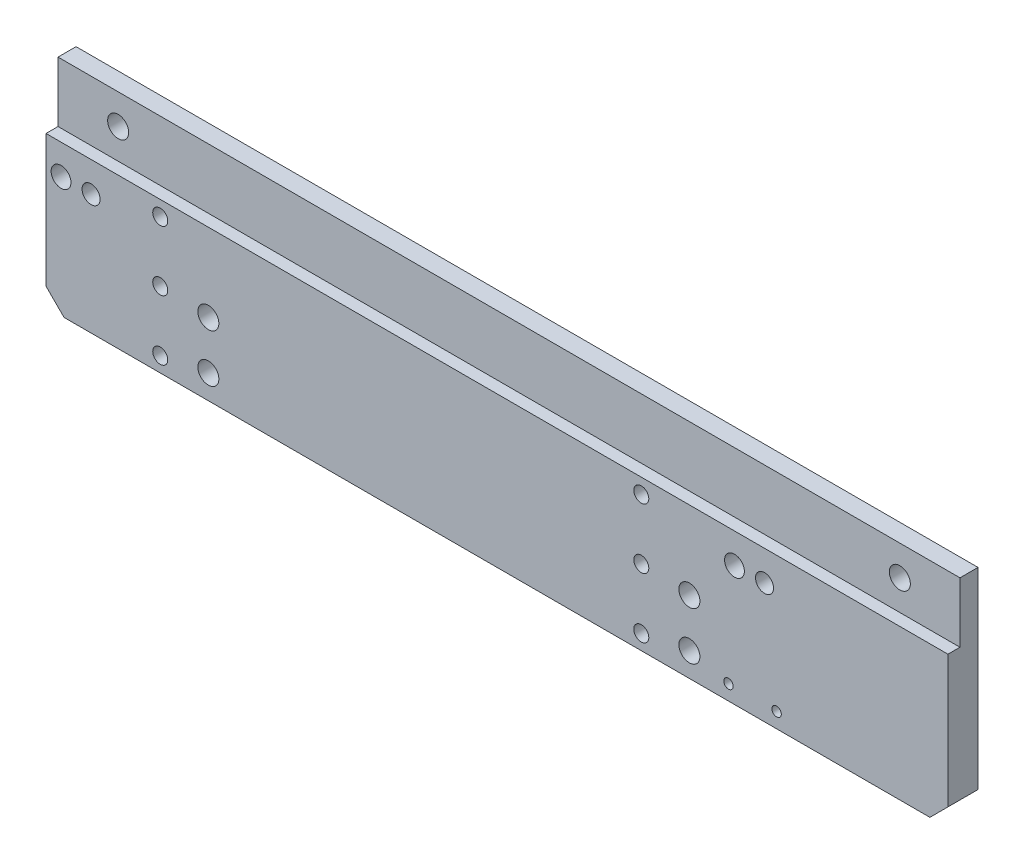
ISO-10303-21;
HEADER;
FILE_DESCRIPTION(('STEP AP214'),'2;1');
FILE_NAME('part.step','',(''),(''),'','','');
FILE_SCHEMA(('AUTOMOTIVE_DESIGN { 1 0 10303 214 1 1 1 1 }'));
ENDSEC;
DATA;
#1=APPLICATION_CONTEXT('core data for automotive mechanical design processes');
#2=APPLICATION_PROTOCOL_DEFINITION('international standard','automotive_design',2000,#1);
#3=PRODUCT_CONTEXT('',#1,'mechanical');
#4=PRODUCT('Part','Part','',(#3));
#5=PRODUCT_RELATED_PRODUCT_CATEGORY('part','',(#4));
#6=PRODUCT_DEFINITION_FORMATION('','',#4);
#7=PRODUCT_DEFINITION_CONTEXT('part definition',#1,'design');
#8=PRODUCT_DEFINITION('design','',#6,#7);
#9=PRODUCT_DEFINITION_SHAPE('','',#8);
#10=(LENGTH_UNIT() NAMED_UNIT(*) SI_UNIT(.MILLI.,.METRE.));
#11=(NAMED_UNIT(*) PLANE_ANGLE_UNIT() SI_UNIT($,.RADIAN.));
#12=(NAMED_UNIT(*) SI_UNIT($,.STERADIAN.) SOLID_ANGLE_UNIT());
#13=UNCERTAINTY_MEASURE_WITH_UNIT(LENGTH_MEASURE(1.E-05),#10,'distance_accuracy_value','');
#14=(GEOMETRIC_REPRESENTATION_CONTEXT(3) GLOBAL_UNCERTAINTY_ASSIGNED_CONTEXT((#13)) GLOBAL_UNIT_ASSIGNED_CONTEXT((#10,
#11,#12)) REPRESENTATION_CONTEXT('',''));
#15=CARTESIAN_POINT('',(0.,0.,0.));
#16=DIRECTION('',(0.,0.,1.));
#17=DIRECTION('',(1.,0.,0.));
#18=AXIS2_PLACEMENT_3D('',#15,#16,#17);
#19=CARTESIAN_POINT('',(-56.,-15.,5.));
#20=DIRECTION('',(0.,0.,-1.));
#21=DIRECTION('',(-1.,0.,0.));
#22=AXIS2_PLACEMENT_3D('',#19,#20,#21);
#23=CYLINDRICAL_SURFACE('',#22,1.25);
#24=CARTESIAN_POINT('',(-56.,-15.,5.));
#25=DIRECTION('',(0.,0.,-1.));
#26=DIRECTION('',(-1.,0.,0.));
#27=AXIS2_PLACEMENT_3D('',#24,#25,#26);
#28=CIRCLE('',#27,1.25);
#29=CARTESIAN_POINT('',(-57.25,-15.,5.));
#30=VERTEX_POINT('',#29);
#31=EDGE_CURVE('E210',#30,#30,#28,.T.);
#32=ORIENTED_EDGE('',*,*,#31,.F.);
#33=EDGE_LOOP('',(#32));
#34=FACE_BOUND('',#33,.T.);
#35=CARTESIAN_POINT('',(-56.,-15.,2.5));
#36=DIRECTION('',(0.,0.,-1.));
#37=DIRECTION('',(-1.,0.,0.));
#38=AXIS2_PLACEMENT_3D('',#35,#36,#37);
#39=CIRCLE('',#38,1.25);
#40=CARTESIAN_POINT('',(-57.25,-15.,2.5));
#41=VERTEX_POINT('',#40);
#42=EDGE_CURVE('E11',#41,#41,#39,.T.);
#43=ORIENTED_EDGE('',*,*,#42,.T.);
#44=EDGE_LOOP('',(#43));
#45=FACE_BOUND('',#44,.T.);
#46=ADVANCED_FACE('F33',(#34,#45),#23,.F.);
#47=CARTESIAN_POINT('',(-56.,-15.,2.5));
#48=DIRECTION('',(0.,0.,-1.));
#49=DIRECTION('',(-1.,0.,0.));
#50=AXIS2_PLACEMENT_3D('',#47,#48,#49);
#51=PLANE('',#50);
#52=ORIENTED_EDGE('',*,*,#42,.F.);
#53=EDGE_LOOP('',(#52));
#54=FACE_BOUND('',#53,.T.);
#55=CARTESIAN_POINT('',(-56.,-15.,2.5));
#56=DIRECTION('',(0.,0.,-1.));
#57=DIRECTION('',(-1.,0.,0.));
#58=AXIS2_PLACEMENT_3D('',#55,#56,#57);
#59=CIRCLE('',#58,2.);
#60=CARTESIAN_POINT('',(-58.,-15.,2.5));
#61=VERTEX_POINT('',#60);
#62=EDGE_CURVE('E40',#61,#61,#59,.T.);
#63=ORIENTED_EDGE('',*,*,#62,.T.);
#64=EDGE_LOOP('',(#63));
#65=FACE_BOUND('',#64,.T.);
#66=ADVANCED_FACE('F218',(#54,#65),#51,.T.);
#67=CARTESIAN_POINT('',(-56.,-15.,2.5));
#68=DIRECTION('',(0.,0.,-1.));
#69=DIRECTION('',(-1.,0.,0.));
#70=AXIS2_PLACEMENT_3D('',#67,#68,#69);
#71=CYLINDRICAL_SURFACE('',#70,2.);
#72=ORIENTED_EDGE('',*,*,#62,.F.);
#73=EDGE_LOOP('',(#72));
#74=FACE_BOUND('',#73,.T.);
#75=CARTESIAN_POINT('',(-56.,-15.,0.));
#76=DIRECTION('',(0.,0.,-1.));
#77=DIRECTION('',(-1.,0.,0.));
#78=AXIS2_PLACEMENT_3D('',#75,#76,#77);
#79=CIRCLE('',#78,2.);
#80=CARTESIAN_POINT('',(-58.,-15.,0.));
#81=VERTEX_POINT('',#80);
#82=EDGE_CURVE('E213',#81,#81,#79,.T.);
#83=ORIENTED_EDGE('',*,*,#82,.T.);
#84=EDGE_LOOP('',(#83));
#85=FACE_BOUND('',#84,.T.);
#86=ADVANCED_FACE('F220',(#74,#85),#71,.F.);
#87=CARTESIAN_POINT('',(-56.,-5.,5.));
#88=DIRECTION('',(0.,0.,-1.));
#89=DIRECTION('',(-1.,0.,0.));
#90=AXIS2_PLACEMENT_3D('',#87,#88,#89);
#91=CYLINDRICAL_SURFACE('',#90,1.25);
#92=CARTESIAN_POINT('',(-56.,-5.,5.));
#93=DIRECTION('',(0.,0.,-1.));
#94=DIRECTION('',(-1.,0.,0.));
#95=AXIS2_PLACEMENT_3D('',#92,#93,#94);
#96=CIRCLE('',#95,1.25);
#97=CARTESIAN_POINT('',(-57.25,-5.,5.));
#98=VERTEX_POINT('',#97);
#99=EDGE_CURVE('E198',#98,#98,#96,.T.);
#100=ORIENTED_EDGE('',*,*,#99,.F.);
#101=EDGE_LOOP('',(#100));
#102=FACE_BOUND('',#101,.T.);
#103=CARTESIAN_POINT('',(-56.,-5.,2.5));
#104=DIRECTION('',(0.,0.,-1.));
#105=DIRECTION('',(-1.,0.,0.));
#106=AXIS2_PLACEMENT_3D('',#103,#104,#105);
#107=CIRCLE('',#106,1.25);
#108=CARTESIAN_POINT('',(-57.25,-5.,2.5));
#109=VERTEX_POINT('',#108);
#110=EDGE_CURVE('E207',#109,#109,#107,.T.);
#111=ORIENTED_EDGE('',*,*,#110,.T.);
#112=EDGE_LOOP('',(#111));
#113=FACE_BOUND('',#112,.T.);
#114=ADVANCED_FACE('F223',(#102,#113),#91,.F.);
#115=CARTESIAN_POINT('',(-56.,-5.,2.5));
#116=DIRECTION('',(0.,0.,-1.));
#117=DIRECTION('',(-1.,0.,0.));
#118=AXIS2_PLACEMENT_3D('',#115,#116,#117);
#119=PLANE('',#118);
#120=ORIENTED_EDGE('',*,*,#110,.F.);
#121=EDGE_LOOP('',(#120));
#122=FACE_BOUND('',#121,.T.);
#123=CARTESIAN_POINT('',(-56.,-5.,2.5));
#124=DIRECTION('',(0.,0.,-1.));
#125=DIRECTION('',(-1.,0.,0.));
#126=AXIS2_PLACEMENT_3D('',#123,#124,#125);
#127=CIRCLE('',#126,2.);
#128=CARTESIAN_POINT('',(-58.,-5.,2.5));
#129=VERTEX_POINT('',#128);
#130=EDGE_CURVE('E204',#129,#129,#127,.T.);
#131=ORIENTED_EDGE('',*,*,#130,.T.);
#132=EDGE_LOOP('',(#131));
#133=FACE_BOUND('',#132,.T.);
#134=ADVANCED_FACE('F259',(#122,#133),#119,.T.);
#135=CARTESIAN_POINT('',(-56.,-5.,2.5));
#136=DIRECTION('',(0.,0.,-1.));
#137=DIRECTION('',(-1.,0.,0.));
#138=AXIS2_PLACEMENT_3D('',#135,#136,#137);
#139=CYLINDRICAL_SURFACE('',#138,2.);
#140=ORIENTED_EDGE('',*,*,#130,.F.);
#141=EDGE_LOOP('',(#140));
#142=FACE_BOUND('',#141,.T.);
#143=CARTESIAN_POINT('',(-56.,-5.,0.));
#144=DIRECTION('',(0.,0.,-1.));
#145=DIRECTION('',(-1.,0.,0.));
#146=AXIS2_PLACEMENT_3D('',#143,#144,#145);
#147=CIRCLE('',#146,2.);
#148=CARTESIAN_POINT('',(-58.,-5.,0.));
#149=VERTEX_POINT('',#148);
#150=EDGE_CURVE('E201',#149,#149,#147,.T.);
#151=ORIENTED_EDGE('',*,*,#150,.T.);
#152=EDGE_LOOP('',(#151));
#153=FACE_BOUND('',#152,.T.);
#154=ADVANCED_FACE('F263',(#142,#153),#139,.F.);
#155=CARTESIAN_POINT('',(-56.,5.,5.));
#156=DIRECTION('',(0.,0.,-1.));
#157=DIRECTION('',(-1.,0.,0.));
#158=AXIS2_PLACEMENT_3D('',#155,#156,#157);
#159=CYLINDRICAL_SURFACE('',#158,1.25);
#160=CARTESIAN_POINT('',(-56.,5.,5.));
#161=DIRECTION('',(0.,0.,-1.));
#162=DIRECTION('',(-1.,0.,0.));
#163=AXIS2_PLACEMENT_3D('',#160,#161,#162);
#164=CIRCLE('',#163,1.25);
#165=CARTESIAN_POINT('',(-57.25,5.,5.));
#166=VERTEX_POINT('',#165);
#167=EDGE_CURVE('E186',#166,#166,#164,.T.);
#168=ORIENTED_EDGE('',*,*,#167,.F.);
#169=EDGE_LOOP('',(#168));
#170=FACE_BOUND('',#169,.T.);
#171=CARTESIAN_POINT('',(-56.,5.,2.5));
#172=DIRECTION('',(0.,0.,-1.));
#173=DIRECTION('',(-1.,0.,0.));
#174=AXIS2_PLACEMENT_3D('',#171,#172,#173);
#175=CIRCLE('',#174,1.25);
#176=CARTESIAN_POINT('',(-57.25,5.,2.5));
#177=VERTEX_POINT('',#176);
#178=EDGE_CURVE('E195',#177,#177,#175,.T.);
#179=ORIENTED_EDGE('',*,*,#178,.T.);
#180=EDGE_LOOP('',(#179));
#181=FACE_BOUND('',#180,.T.);
#182=ADVANCED_FACE('F267',(#170,#181),#159,.F.);
#183=CARTESIAN_POINT('',(-56.,5.,2.5));
#184=DIRECTION('',(0.,0.,-1.));
#185=DIRECTION('',(-1.,0.,0.));
#186=AXIS2_PLACEMENT_3D('',#183,#184,#185);
#187=PLANE('',#186);
#188=ORIENTED_EDGE('',*,*,#178,.F.);
#189=EDGE_LOOP('',(#188));
#190=FACE_BOUND('',#189,.T.);
#191=CARTESIAN_POINT('',(-56.,5.,2.5));
#192=DIRECTION('',(0.,0.,-1.));
#193=DIRECTION('',(-1.,0.,0.));
#194=AXIS2_PLACEMENT_3D('',#191,#192,#193);
#195=CIRCLE('',#194,2.);
#196=CARTESIAN_POINT('',(-58.,5.,2.5));
#197=VERTEX_POINT('',#196);
#198=EDGE_CURVE('E192',#197,#197,#195,.T.);
#199=ORIENTED_EDGE('',*,*,#198,.T.);
#200=EDGE_LOOP('',(#199));
#201=FACE_BOUND('',#200,.T.);
#202=ADVANCED_FACE('F271',(#190,#201),#187,.T.);
#203=CARTESIAN_POINT('',(-56.,5.,2.5));
#204=DIRECTION('',(0.,0.,-1.));
#205=DIRECTION('',(-1.,0.,0.));
#206=AXIS2_PLACEMENT_3D('',#203,#204,#205);
#207=CYLINDRICAL_SURFACE('',#206,2.);
#208=ORIENTED_EDGE('',*,*,#198,.F.);
#209=EDGE_LOOP('',(#208));
#210=FACE_BOUND('',#209,.T.);
#211=CARTESIAN_POINT('',(-56.,5.,0.));
#212=DIRECTION('',(0.,0.,-1.));
#213=DIRECTION('',(-1.,0.,0.));
#214=AXIS2_PLACEMENT_3D('',#211,#212,#213);
#215=CIRCLE('',#214,2.);
#216=CARTESIAN_POINT('',(-58.,5.,0.));
#217=VERTEX_POINT('',#216);
#218=EDGE_CURVE('E189',#217,#217,#215,.T.);
#219=ORIENTED_EDGE('',*,*,#218,.T.);
#220=EDGE_LOOP('',(#219));
#221=FACE_BOUND('',#220,.T.);
#222=ADVANCED_FACE('F275',(#210,#221),#207,.F.);
#223=CARTESIAN_POINT('',(24.,-15.,5.));
#224=DIRECTION('',(0.,0.,-1.));
#225=DIRECTION('',(-1.,0.,0.));
#226=AXIS2_PLACEMENT_3D('',#223,#224,#225);
#227=CYLINDRICAL_SURFACE('',#226,1.25);
#228=CARTESIAN_POINT('',(24.,-15.,5.));
#229=DIRECTION('',(0.,0.,-1.));
#230=DIRECTION('',(-1.,0.,0.));
#231=AXIS2_PLACEMENT_3D('',#228,#229,#230);
#232=CIRCLE('',#231,1.25);
#233=CARTESIAN_POINT('',(22.75,-15.,5.));
#234=VERTEX_POINT('',#233);
#235=EDGE_CURVE('E168',#234,#234,#232,.T.);
#236=ORIENTED_EDGE('',*,*,#235,.F.);
#237=EDGE_LOOP('',(#236));
#238=FACE_BOUND('',#237,.T.);
#239=CARTESIAN_POINT('',(24.,-15.,2.5));
#240=DIRECTION('',(0.,0.,-1.));
#241=DIRECTION('',(-1.,0.,0.));
#242=AXIS2_PLACEMENT_3D('',#239,#240,#241);
#243=CIRCLE('',#242,1.25);
#244=CARTESIAN_POINT('',(22.75,-15.,2.5));
#245=VERTEX_POINT('',#244);
#246=EDGE_CURVE('E183',#245,#245,#243,.T.);
#247=ORIENTED_EDGE('',*,*,#246,.T.);
#248=EDGE_LOOP('',(#247));
#249=FACE_BOUND('',#248,.T.);
#250=ADVANCED_FACE('F279',(#238,#249),#227,.F.);
#251=CARTESIAN_POINT('',(24.,-15.,2.5));
#252=DIRECTION('',(0.,0.,-1.));
#253=DIRECTION('',(-1.,0.,0.));
#254=AXIS2_PLACEMENT_3D('',#251,#252,#253);
#255=PLANE('',#254);
#256=ORIENTED_EDGE('',*,*,#246,.F.);
#257=EDGE_LOOP('',(#256));
#258=FACE_BOUND('',#257,.T.);
#259=CARTESIAN_POINT('',(24.,-15.,2.5));
#260=DIRECTION('',(0.,0.,-1.));
#261=DIRECTION('',(-1.,0.,0.));
#262=AXIS2_PLACEMENT_3D('',#259,#260,#261);
#263=CIRCLE('',#262,2.);
#264=CARTESIAN_POINT('',(22.,-15.,2.5));
#265=VERTEX_POINT('',#264);
#266=EDGE_CURVE('E180',#265,#265,#263,.T.);
#267=ORIENTED_EDGE('',*,*,#266,.T.);
#268=EDGE_LOOP('',(#267));
#269=FACE_BOUND('',#268,.T.);
#270=ADVANCED_FACE('F283',(#258,#269),#255,.T.);
#271=CARTESIAN_POINT('',(24.,-15.,2.5));
#272=DIRECTION('',(0.,0.,-1.));
#273=DIRECTION('',(-1.,0.,0.));
#274=AXIS2_PLACEMENT_3D('',#271,#272,#273);
#275=CYLINDRICAL_SURFACE('',#274,2.);
#276=ORIENTED_EDGE('',*,*,#266,.F.);
#277=EDGE_LOOP('',(#276));
#278=FACE_BOUND('',#277,.T.);
#279=CARTESIAN_POINT('',(24.,-15.,0.));
#280=DIRECTION('',(0.,0.,-1.));
#281=DIRECTION('',(-1.,0.,0.));
#282=AXIS2_PLACEMENT_3D('',#279,#280,#281);
#283=CIRCLE('',#282,2.);
#284=CARTESIAN_POINT('',(22.,-15.,0.));
#285=VERTEX_POINT('',#284);
#286=EDGE_CURVE('E177',#285,#285,#283,.T.);
#287=ORIENTED_EDGE('',*,*,#286,.T.);
#288=EDGE_LOOP('',(#287));
#289=FACE_BOUND('',#288,.T.);
#290=ADVANCED_FACE('F287',(#278,#289),#275,.F.);
#291=CARTESIAN_POINT('',(75.,-14.5,5.));
#292=DIRECTION('',(-1.,0.,0.));
#293=DIRECTION('',(0.,0.,1.));
#294=AXIS2_PLACEMENT_3D('',#291,#292,#293);
#295=PLANE('',#294);
#296=DIRECTION('',(0.,0.,-1.));
#297=VECTOR('',#296,1.);
#298=CARTESIAN_POINT('',(75.,17.5,5.));
#299=LINE('',#298,#297);
#300=CARTESIAN_POINT('',(75.,17.5,3.));
#301=VERTEX_POINT('',#300);
#302=CARTESIAN_POINT('',(75.,17.5,0.));
#303=VERTEX_POINT('',#302);
#304=EDGE_CURVE('E166',#301,#303,#299,.T.);
#305=ORIENTED_EDGE('',*,*,#304,.F.);
#306=DIRECTION('',(0.,1.,0.));
#307=VECTOR('',#306,1.);
#308=CARTESIAN_POINT('',(75.,7.5,3.));
#309=LINE('',#308,#307);
#310=CARTESIAN_POINT('',(75.,7.5,3.));
#311=VERTEX_POINT('',#310);
#312=EDGE_CURVE('E122',#311,#301,#309,.T.);
#313=ORIENTED_EDGE('',*,*,#312,.F.);
#314=DIRECTION('',(0.,0.,-1.));
#315=VECTOR('',#314,1.);
#316=CARTESIAN_POINT('',(75.,7.5,5.));
#317=LINE('',#316,#315);
#318=CARTESIAN_POINT('',(75.,7.5,5.));
#319=VERTEX_POINT('',#318);
#320=EDGE_CURVE('E108',#319,#311,#317,.T.);
#321=ORIENTED_EDGE('',*,*,#320,.F.);
#322=DIRECTION('',(0.,1.,0.));
#323=VECTOR('',#322,1.);
#324=CARTESIAN_POINT('',(75.,-14.5,5.));
#325=LINE('',#324,#323);
#326=CARTESIAN_POINT('',(75.,-14.5,5.));
#327=VERTEX_POINT('',#326);
#328=EDGE_CURVE('E134',#327,#319,#325,.T.);
#329=ORIENTED_EDGE('',*,*,#328,.F.);
#330=DIRECTION('',(0.,0.,-1.));
#331=VECTOR('',#330,1.);
#332=CARTESIAN_POINT('',(75.,-14.5,5.));
#333=LINE('',#332,#331);
#334=CARTESIAN_POINT('',(75.,-14.5,0.));
#335=VERTEX_POINT('',#334);
#336=EDGE_CURVE('E142',#327,#335,#333,.T.);
#337=ORIENTED_EDGE('',*,*,#336,.T.);
#338=DIRECTION('',(0.,1.,0.));
#339=VECTOR('',#338,1.);
#340=CARTESIAN_POINT('',(75.,-14.5,0.));
#341=LINE('',#340,#339);
#342=EDGE_CURVE('E131',#335,#303,#341,.T.);
#343=ORIENTED_EDGE('',*,*,#342,.T.);
#344=EDGE_LOOP('',(#305,#313,#321,#329,#337,#343));
#345=FACE_BOUND('',#344,.T.);
#346=ADVANCED_FACE('F291',(#345),#295,.F.);
#347=CARTESIAN_POINT('',(-75.,17.5,5.));
#348=DIRECTION('',(0.,-1.,0.));
#349=DIRECTION('',(0.,0.,-1.));
#350=AXIS2_PLACEMENT_3D('',#347,#348,#349);
#351=PLANE('',#350);
#352=DIRECTION('',(0.,0.,-1.));
#353=VECTOR('',#352,1.);
#354=CARTESIAN_POINT('',(-75.,17.5,5.));
#355=LINE('',#354,#353);
#356=CARTESIAN_POINT('',(-75.,17.5,3.));
#357=VERTEX_POINT('',#356);
#358=CARTESIAN_POINT('',(-75.,17.5,0.));
#359=VERTEX_POINT('',#358);
#360=EDGE_CURVE('E164',#357,#359,#355,.T.);
#361=ORIENTED_EDGE('',*,*,#360,.F.);
#362=DIRECTION('',(1.,0.,0.));
#363=VECTOR('',#362,1.);
#364=CARTESIAN_POINT('',(-75.,17.5,3.));
#365=LINE('',#364,#363);
#366=EDGE_CURVE('E111',#357,#301,#365,.T.);
#367=ORIENTED_EDGE('',*,*,#366,.T.);
#368=ORIENTED_EDGE('',*,*,#304,.T.);
#369=DIRECTION('',(-1.,0.,0.));
#370=VECTOR('',#369,1.);
#371=CARTESIAN_POINT('',(-75.,17.5,0.));
#372=LINE('',#371,#370);
#373=EDGE_CURVE('E145',#303,#359,#372,.T.);
#374=ORIENTED_EDGE('',*,*,#373,.T.);
#375=EDGE_LOOP('',(#361,#367,#368,#374));
#376=FACE_BOUND('',#375,.T.);
#377=ADVANCED_FACE('F295',(#376),#351,.F.);
#378=CARTESIAN_POINT('',(-75.,-14.5,5.));
#379=DIRECTION('',(1.,0.,0.));
#380=DIRECTION('',(0.,0.,-1.));
#381=AXIS2_PLACEMENT_3D('',#378,#379,#380);
#382=PLANE('',#381);
#383=DIRECTION('',(0.,0.,-1.));
#384=VECTOR('',#383,1.);
#385=CARTESIAN_POINT('',(-75.,7.5,5.));
#386=LINE('',#385,#384);
#387=CARTESIAN_POINT('',(-75.,7.5,5.));
#388=VERTEX_POINT('',#387);
#389=CARTESIAN_POINT('',(-75.,7.5,3.));
#390=VERTEX_POINT('',#389);
#391=EDGE_CURVE('E47',#388,#390,#386,.T.);
#392=ORIENTED_EDGE('',*,*,#391,.T.);
#393=DIRECTION('',(0.,1.,0.));
#394=VECTOR('',#393,1.);
#395=CARTESIAN_POINT('',(-75.,7.5,3.));
#396=LINE('',#395,#394);
#397=EDGE_CURVE('E115',#390,#357,#396,.T.);
#398=ORIENTED_EDGE('',*,*,#397,.T.);
#399=ORIENTED_EDGE('',*,*,#360,.T.);
#400=DIRECTION('',(0.,-1.,0.));
#401=VECTOR('',#400,1.);
#402=CARTESIAN_POINT('',(-75.,-14.5,0.));
#403=LINE('',#402,#401);
#404=CARTESIAN_POINT('',(-75.,-14.5,0.));
#405=VERTEX_POINT('',#404);
#406=EDGE_CURVE('E148',#359,#405,#403,.T.);
#407=ORIENTED_EDGE('',*,*,#406,.T.);
#408=DIRECTION('',(0.,0.,-1.));
#409=VECTOR('',#408,1.);
#410=CARTESIAN_POINT('',(-75.,-14.5,5.));
#411=LINE('',#410,#409);
#412=CARTESIAN_POINT('',(-75.,-14.5,5.));
#413=VERTEX_POINT('',#412);
#414=EDGE_CURVE('E161',#413,#405,#411,.T.);
#415=ORIENTED_EDGE('',*,*,#414,.F.);
#416=DIRECTION('',(0.,-1.,0.));
#417=VECTOR('',#416,1.);
#418=CARTESIAN_POINT('',(-75.,-14.5,5.));
#419=LINE('',#418,#417);
#420=EDGE_CURVE('E89',#388,#413,#419,.T.);
#421=ORIENTED_EDGE('',*,*,#420,.F.);
#422=EDGE_LOOP('',(#392,#398,#399,#407,#415,#421));
#423=FACE_BOUND('',#422,.T.);
#424=ADVANCED_FACE('F121',(#423),#382,.F.);
#425=CARTESIAN_POINT('',(-75.,-14.5,5.));
#426=DIRECTION('',(0.707106781186547,0.707106781186548,0.));
#427=DIRECTION('',(-0.707106781186548,0.707106781186547,0.));
#428=AXIS2_PLACEMENT_3D('',#425,#426,#427);
#429=PLANE('',#428);
#430=DIRECTION('',(0.707106781186548,-0.707106781186547,0.));
#431=VECTOR('',#430,1.);
#432=CARTESIAN_POINT('',(-75.,-14.5,0.));
#433=LINE('',#432,#431);
#434=CARTESIAN_POINT('',(-72.,-17.5,0.));
#435=VERTEX_POINT('',#434);
#436=EDGE_CURVE('E150',#405,#435,#433,.T.);
#437=ORIENTED_EDGE('',*,*,#436,.T.);
#438=DIRECTION('',(0.,0.,-1.));
#439=VECTOR('',#438,1.);
#440=CARTESIAN_POINT('',(-72.,-17.5,5.));
#441=LINE('',#440,#439);
#442=CARTESIAN_POINT('',(-72.,-17.5,5.));
#443=VERTEX_POINT('',#442);
#444=EDGE_CURVE('E158',#443,#435,#441,.T.);
#445=ORIENTED_EDGE('',*,*,#444,.F.);
#446=DIRECTION('',(0.707106781186548,-0.707106781186547,0.));
#447=VECTOR('',#446,1.);
#448=CARTESIAN_POINT('',(-75.,-14.5,5.));
#449=LINE('',#448,#447);
#450=EDGE_CURVE('E137',#413,#443,#449,.T.);
#451=ORIENTED_EDGE('',*,*,#450,.F.);
#452=ORIENTED_EDGE('',*,*,#414,.T.);
#453=EDGE_LOOP('',(#437,#445,#451,#452));
#454=FACE_BOUND('',#453,.T.);
#455=ADVANCED_FACE('F302',(#454),#429,.F.);
#456=CARTESIAN_POINT('',(-72.,-17.5,5.));
#457=DIRECTION('',(0.,1.,0.));
#458=DIRECTION('',(0.,0.,1.));
#459=AXIS2_PLACEMENT_3D('',#456,#457,#458);
#460=PLANE('',#459);
#461=DIRECTION('',(1.,0.,0.));
#462=VECTOR('',#461,1.);
#463=CARTESIAN_POINT('',(-72.,-17.5,0.));
#464=LINE('',#463,#462);
#465=CARTESIAN_POINT('',(72.,-17.5,0.));
#466=VERTEX_POINT('',#465);
#467=EDGE_CURVE('E152',#435,#466,#464,.T.);
#468=ORIENTED_EDGE('',*,*,#467,.T.);
#469=DIRECTION('',(0.,0.,-1.));
#470=VECTOR('',#469,1.);
#471=CARTESIAN_POINT('',(72.,-17.5,5.));
#472=LINE('',#471,#470);
#473=CARTESIAN_POINT('',(72.,-17.5,5.));
#474=VERTEX_POINT('',#473);
#475=EDGE_CURVE('E156',#474,#466,#472,.T.);
#476=ORIENTED_EDGE('',*,*,#475,.F.);
#477=DIRECTION('',(1.,0.,0.));
#478=VECTOR('',#477,1.);
#479=CARTESIAN_POINT('',(-72.,-17.5,5.));
#480=LINE('',#479,#478);
#481=EDGE_CURVE('E139',#443,#474,#480,.T.);
#482=ORIENTED_EDGE('',*,*,#481,.F.);
#483=ORIENTED_EDGE('',*,*,#444,.T.);
#484=EDGE_LOOP('',(#468,#476,#482,#483));
#485=FACE_BOUND('',#484,.T.);
#486=ADVANCED_FACE('F305',(#485),#460,.F.);
#487=CARTESIAN_POINT('',(72.,-17.5,5.));
#488=DIRECTION('',(-0.707106781186547,0.707106781186548,0.));
#489=DIRECTION('',(-0.707106781186548,-0.707106781186547,0.));
#490=AXIS2_PLACEMENT_3D('',#487,#488,#489);
#491=PLANE('',#490);
#492=DIRECTION('',(0.707106781186548,0.707106781186547,0.));
#493=VECTOR('',#492,1.);
#494=CARTESIAN_POINT('',(72.,-17.5,0.));
#495=LINE('',#494,#493);
#496=EDGE_CURVE('E83',#466,#335,#495,.T.);
#497=ORIENTED_EDGE('',*,*,#496,.T.);
#498=ORIENTED_EDGE('',*,*,#336,.F.);
#499=DIRECTION('',(0.707106781186548,0.707106781186547,0.));
#500=VECTOR('',#499,1.);
#501=CARTESIAN_POINT('',(72.,-17.5,5.));
#502=LINE('',#501,#500);
#503=EDGE_CURVE('E56',#474,#327,#502,.T.);
#504=ORIENTED_EDGE('',*,*,#503,.F.);
#505=ORIENTED_EDGE('',*,*,#475,.T.);
#506=EDGE_LOOP('',(#497,#498,#504,#505));
#507=FACE_BOUND('',#506,.T.);
#508=ADVANCED_FACE('F238',(#507),#491,.F.);
#509=CARTESIAN_POINT('',(0.,0.,5.));
#510=DIRECTION('',(0.,0.,-1.));
#511=DIRECTION('',(-1.,0.,0.));
#512=AXIS2_PLACEMENT_3D('',#509,#510,#511);
#513=PLANE('',#512);
#514=CARTESIAN_POINT('',(24.,-5.,5.));
#515=DIRECTION('',(0.,0.,-1.));
#516=DIRECTION('',(-1.,0.,0.));
#517=AXIS2_PLACEMENT_3D('',#514,#515,#516);
#518=CIRCLE('',#517,1.25);
#519=CARTESIAN_POINT('',(22.75,-5.,5.));
#520=VERTEX_POINT('',#519);
#521=EDGE_CURVE('E775',#520,#520,#518,.T.);
#522=ORIENTED_EDGE('',*,*,#521,.T.);
#523=EDGE_LOOP('',(#522));
#524=FACE_BOUND('',#523,.T.);
#525=CARTESIAN_POINT('',(24.,5.,5.));
#526=DIRECTION('',(0.,0.,-1.));
#527=DIRECTION('',(-1.,0.,0.));
#528=AXIS2_PLACEMENT_3D('',#525,#526,#527);
#529=CIRCLE('',#528,1.25);
#530=CARTESIAN_POINT('',(22.75,5.,5.));
#531=VERTEX_POINT('',#530);
#532=EDGE_CURVE('E759',#531,#531,#529,.T.);
#533=ORIENTED_EDGE('',*,*,#532,.T.);
#534=EDGE_LOOP('',(#533));
#535=FACE_BOUND('',#534,.T.);
#536=CARTESIAN_POINT('',(-72.5,2.5,5.));
#537=DIRECTION('',(0.,0.,-1.));
#538=DIRECTION('',(-1.,0.,0.));
#539=AXIS2_PLACEMENT_3D('',#536,#537,#538);
#540=CIRCLE('',#539,1.65);
#541=CARTESIAN_POINT('',(-74.15,2.5,5.));
#542=VERTEX_POINT('',#541);
#543=EDGE_CURVE('E669',#542,#542,#540,.T.);
#544=ORIENTED_EDGE('',*,*,#543,.T.);
#545=EDGE_LOOP('',(#544));
#546=FACE_BOUND('',#545,.T.);
#547=CARTESIAN_POINT('',(-67.5,2.5,5.));
#548=DIRECTION('',(0.,0.,-1.));
#549=DIRECTION('',(-1.,0.,0.));
#550=AXIS2_PLACEMENT_3D('',#547,#548,#549);
#551=CIRCLE('',#550,1.49999999999998);
#552=CARTESIAN_POINT('',(-69.,2.5,5.));
#553=VERTEX_POINT('',#552);
#554=EDGE_CURVE('E663',#553,#553,#551,.T.);
#555=ORIENTED_EDGE('',*,*,#554,.T.);
#556=EDGE_LOOP('',(#555));
#557=FACE_BOUND('',#556,.T.);
#558=CARTESIAN_POINT('',(-48.,-13.5,5.));
#559=DIRECTION('',(0.,0.,-1.));
#560=DIRECTION('',(-1.,0.,0.));
#561=AXIS2_PLACEMENT_3D('',#558,#559,#560);
#562=CIRCLE('',#561,1.75);
#563=CARTESIAN_POINT('',(-49.75,-13.5,5.));
#564=VERTEX_POINT('',#563);
#565=EDGE_CURVE('E656',#564,#564,#562,.T.);
#566=ORIENTED_EDGE('',*,*,#565,.T.);
#567=EDGE_LOOP('',(#566));
#568=FACE_BOUND('',#567,.T.);
#569=CARTESIAN_POINT('',(46.5,-15.,5.));
#570=DIRECTION('',(0.,0.,-1.));
#571=DIRECTION('',(-1.,0.,0.));
#572=AXIS2_PLACEMENT_3D('',#569,#570,#571);
#573=CIRCLE('',#572,0.785);
#574=CARTESIAN_POINT('',(45.715,-15.,5.));
#575=VERTEX_POINT('',#574);
#576=EDGE_CURVE('E635',#575,#575,#573,.T.);
#577=ORIENTED_EDGE('',*,*,#576,.T.);
#578=EDGE_LOOP('',(#577));
#579=FACE_BOUND('',#578,.T.);
#580=CARTESIAN_POINT('',(39.5,2.5,5.));
#581=DIRECTION('',(0.,0.,-1.));
#582=DIRECTION('',(-1.,0.,0.));
#583=AXIS2_PLACEMENT_3D('',#580,#581,#582);
#584=CIRCLE('',#583,1.65);
#585=CARTESIAN_POINT('',(37.85,2.5,5.));
#586=VERTEX_POINT('',#585);
#587=EDGE_CURVE('E627',#586,#586,#584,.T.);
#588=ORIENTED_EDGE('',*,*,#587,.T.);
#589=EDGE_LOOP('',(#588));
#590=FACE_BOUND('',#589,.T.);
#591=CARTESIAN_POINT('',(44.5,2.5,5.));
#592=DIRECTION('',(0.,0.,-1.));
#593=DIRECTION('',(-1.,0.,0.));
#594=AXIS2_PLACEMENT_3D('',#591,#592,#593);
#595=CIRCLE('',#594,1.5);
#596=CARTESIAN_POINT('',(43.,2.5,5.));
#597=VERTEX_POINT('',#596);
#598=EDGE_CURVE('E623',#597,#597,#595,.T.);
#599=ORIENTED_EDGE('',*,*,#598,.T.);
#600=EDGE_LOOP('',(#599));
#601=FACE_BOUND('',#600,.T.);
#602=CARTESIAN_POINT('',(-48.,-5.50000000000001,5.));
#603=DIRECTION('',(0.,0.,-1.));
#604=DIRECTION('',(-1.,0.,0.));
#605=AXIS2_PLACEMENT_3D('',#602,#603,#604);
#606=CIRCLE('',#605,1.75);
#607=CARTESIAN_POINT('',(-49.75,-5.50000000000001,5.));
#608=VERTEX_POINT('',#607);
#609=EDGE_CURVE('E682',#608,#608,#606,.T.);
#610=ORIENTED_EDGE('',*,*,#609,.T.);
#611=EDGE_LOOP('',(#610));
#612=FACE_BOUND('',#611,.T.);
#613=CARTESIAN_POINT('',(32.,-13.5,5.));
#614=DIRECTION('',(0.,0.,-1.));
#615=DIRECTION('',(-1.,0.,0.));
#616=AXIS2_PLACEMENT_3D('',#613,#614,#615);
#617=CIRCLE('',#616,1.75);
#618=CARTESIAN_POINT('',(30.25,-13.5,5.));
#619=VERTEX_POINT('',#618);
#620=EDGE_CURVE('E676',#619,#619,#617,.T.);
#621=ORIENTED_EDGE('',*,*,#620,.T.);
#622=EDGE_LOOP('',(#621));
#623=FACE_BOUND('',#622,.T.);
#624=CARTESIAN_POINT('',(32.,-5.50000000000001,5.));
#625=DIRECTION('',(0.,0.,-1.));
#626=DIRECTION('',(-1.,0.,0.));
#627=AXIS2_PLACEMENT_3D('',#624,#625,#626);
#628=CIRCLE('',#627,1.75);
#629=CARTESIAN_POINT('',(30.25,-5.50000000000001,5.));
#630=VERTEX_POINT('',#629);
#631=EDGE_CURVE('E691',#630,#630,#628,.T.);
#632=ORIENTED_EDGE('',*,*,#631,.T.);
#633=EDGE_LOOP('',(#632));
#634=FACE_BOUND('',#633,.T.);
#635=CARTESIAN_POINT('',(38.5,-15.,5.));
#636=DIRECTION('',(0.,0.,-1.));
#637=DIRECTION('',(-1.,0.,0.));
#638=AXIS2_PLACEMENT_3D('',#635,#636,#637);
#639=CIRCLE('',#638,0.785);
#640=CARTESIAN_POINT('',(37.715,-15.,5.));
#641=VERTEX_POINT('',#640);
#642=EDGE_CURVE('E646',#641,#641,#639,.T.);
#643=ORIENTED_EDGE('',*,*,#642,.T.);
#644=EDGE_LOOP('',(#643));
#645=FACE_BOUND('',#644,.T.);
#646=ORIENTED_EDGE('',*,*,#328,.T.);
#647=DIRECTION('',(1.,0.,0.));
#648=VECTOR('',#647,1.);
#649=CARTESIAN_POINT('',(-75.,7.5,5.));
#650=LINE('',#649,#648);
#651=EDGE_CURVE('E112',#388,#319,#650,.T.);
#652=ORIENTED_EDGE('',*,*,#651,.F.);
#653=ORIENTED_EDGE('',*,*,#420,.T.);
#654=ORIENTED_EDGE('',*,*,#450,.T.);
#655=ORIENTED_EDGE('',*,*,#481,.T.);
#656=ORIENTED_EDGE('',*,*,#503,.T.);
#657=EDGE_LOOP('',(#646,#652,#653,#654,#655,#656));
#658=FACE_BOUND('',#657,.T.);
#659=ORIENTED_EDGE('',*,*,#235,.T.);
#660=EDGE_LOOP('',(#659));
#661=FACE_BOUND('',#660,.T.);
#662=ORIENTED_EDGE('',*,*,#167,.T.);
#663=EDGE_LOOP('',(#662));
#664=FACE_BOUND('',#663,.T.);
#665=ORIENTED_EDGE('',*,*,#99,.T.);
#666=EDGE_LOOP('',(#665));
#667=FACE_BOUND('',#666,.T.);
#668=ORIENTED_EDGE('',*,*,#31,.T.);
#669=EDGE_LOOP('',(#668));
#670=FACE_BOUND('',#669,.T.);
#671=ADVANCED_FACE('F229',(#524,#535,#546,#557,#568,#579,#590,#601,#612,#623,#634,#645,#658,
#661,#664,#667,#670),#513,.F.);
#672=CARTESIAN_POINT('',(0.,0.,0.));
#673=DIRECTION('',(0.,0.,-1.));
#674=DIRECTION('',(-1.,0.,0.));
#675=AXIS2_PLACEMENT_3D('',#672,#673,#674);
#676=PLANE('',#675);
#677=CARTESIAN_POINT('',(24.,-5.,0.));
#678=DIRECTION('',(0.,0.,-1.));
#679=DIRECTION('',(-1.,0.,0.));
#680=AXIS2_PLACEMENT_3D('',#677,#678,#679);
#681=CIRCLE('',#680,2.);
#682=CARTESIAN_POINT('',(22.,-5.,0.));
#683=VERTEX_POINT('',#682);
#684=EDGE_CURVE('E772',#683,#683,#681,.T.);
#685=ORIENTED_EDGE('',*,*,#684,.F.);
#686=EDGE_LOOP('',(#685));
#687=FACE_BOUND('',#686,.T.);
#688=CARTESIAN_POINT('',(24.,5.,0.));
#689=DIRECTION('',(0.,0.,-1.));
#690=DIRECTION('',(-1.,0.,0.));
#691=AXIS2_PLACEMENT_3D('',#688,#689,#690);
#692=CIRCLE('',#691,2.);
#693=CARTESIAN_POINT('',(22.,5.,0.));
#694=VERTEX_POINT('',#693);
#695=EDGE_CURVE('E654',#694,#694,#692,.T.);
#696=ORIENTED_EDGE('',*,*,#695,.F.);
#697=EDGE_LOOP('',(#696));
#698=FACE_BOUND('',#697,.T.);
#699=CARTESIAN_POINT('',(65.,12.5,0.));
#700=DIRECTION('',(0.,0.,-1.));
#701=DIRECTION('',(-1.,0.,0.));
#702=AXIS2_PLACEMENT_3D('',#699,#700,#701);
#703=CIRCLE('',#702,1.75);
#704=CARTESIAN_POINT('',(63.25,12.5,0.));
#705=VERTEX_POINT('',#704);
#706=EDGE_CURVE('E172',#705,#705,#703,.T.);
#707=ORIENTED_EDGE('',*,*,#706,.F.);
#708=EDGE_LOOP('',(#707));
#709=FACE_BOUND('',#708,.T.);
#710=CARTESIAN_POINT('',(-72.5,2.5,0.));
#711=DIRECTION('',(0.,0.,-1.));
#712=DIRECTION('',(-1.,0.,0.));
#713=AXIS2_PLACEMENT_3D('',#710,#711,#712);
#714=CIRCLE('',#713,1.65);
#715=CARTESIAN_POINT('',(-74.15,2.5,0.));
#716=VERTEX_POINT('',#715);
#717=EDGE_CURVE('E672',#716,#716,#714,.T.);
#718=ORIENTED_EDGE('',*,*,#717,.F.);
#719=EDGE_LOOP('',(#718));
#720=FACE_BOUND('',#719,.T.);
#721=CARTESIAN_POINT('',(-67.5,2.5,0.));
#722=DIRECTION('',(0.,0.,-1.));
#723=DIRECTION('',(-1.,0.,0.));
#724=AXIS2_PLACEMENT_3D('',#721,#722,#723);
#725=CIRCLE('',#724,1.49999999999998);
#726=CARTESIAN_POINT('',(-69.,2.5,0.));
#727=VERTEX_POINT('',#726);
#728=EDGE_CURVE('E666',#727,#727,#725,.T.);
#729=ORIENTED_EDGE('',*,*,#728,.F.);
#730=EDGE_LOOP('',(#729));
#731=FACE_BOUND('',#730,.T.);
#732=CARTESIAN_POINT('',(-48.,-13.5,0.));
#733=DIRECTION('',(0.,0.,-1.));
#734=DIRECTION('',(-1.,0.,0.));
#735=AXIS2_PLACEMENT_3D('',#732,#733,#734);
#736=CIRCLE('',#735,1.75);
#737=CARTESIAN_POINT('',(-49.75,-13.5,0.));
#738=VERTEX_POINT('',#737);
#739=EDGE_CURVE('E660',#738,#738,#736,.T.);
#740=ORIENTED_EDGE('',*,*,#739,.F.);
#741=EDGE_LOOP('',(#740));
#742=FACE_BOUND('',#741,.T.);
#743=CARTESIAN_POINT('',(46.5,-15.,0.));
#744=DIRECTION('',(0.,0.,-1.));
#745=DIRECTION('',(-1.,0.,0.));
#746=AXIS2_PLACEMENT_3D('',#743,#744,#745);
#747=CIRCLE('',#746,0.785);
#748=CARTESIAN_POINT('',(45.715,-15.,0.));
#749=VERTEX_POINT('',#748);
#750=EDGE_CURVE('E643',#749,#749,#747,.T.);
#751=ORIENTED_EDGE('',*,*,#750,.F.);
#752=EDGE_LOOP('',(#751));
#753=FACE_BOUND('',#752,.T.);
#754=CARTESIAN_POINT('',(39.5,2.5,0.));
#755=DIRECTION('',(0.,0.,-1.));
#756=DIRECTION('',(-1.,0.,0.));
#757=AXIS2_PLACEMENT_3D('',#754,#755,#756);
#758=CIRCLE('',#757,1.65);
#759=CARTESIAN_POINT('',(37.85,2.5,0.));
#760=VERTEX_POINT('',#759);
#761=EDGE_CURVE('E630',#760,#760,#758,.T.);
#762=ORIENTED_EDGE('',*,*,#761,.F.);
#763=EDGE_LOOP('',(#762));
#764=FACE_BOUND('',#763,.T.);
#765=CARTESIAN_POINT('',(44.5,2.5,0.));
#766=DIRECTION('',(0.,0.,-1.));
#767=DIRECTION('',(-1.,0.,0.));
#768=AXIS2_PLACEMENT_3D('',#765,#766,#767);
#769=CIRCLE('',#768,1.5);
#770=CARTESIAN_POINT('',(43.,2.5,0.));
#771=VERTEX_POINT('',#770);
#772=EDGE_CURVE('E126',#771,#771,#769,.T.);
#773=ORIENTED_EDGE('',*,*,#772,.F.);
#774=EDGE_LOOP('',(#773));
#775=FACE_BOUND('',#774,.T.);
#776=CARTESIAN_POINT('',(-65.,12.5,0.));
#777=DIRECTION('',(0.,0.,-1.));
#778=DIRECTION('',(-1.,0.,0.));
#779=AXIS2_PLACEMENT_3D('',#776,#777,#778);
#780=CIRCLE('',#779,1.75);
#781=CARTESIAN_POINT('',(-66.75,12.5,0.));
#782=VERTEX_POINT('',#781);
#783=EDGE_CURVE('E628',#782,#782,#780,.T.);
#784=ORIENTED_EDGE('',*,*,#783,.F.);
#785=EDGE_LOOP('',(#784));
#786=FACE_BOUND('',#785,.T.);
#787=CARTESIAN_POINT('',(-48.,-5.50000000000001,0.));
#788=DIRECTION('',(0.,0.,-1.));
#789=DIRECTION('',(-1.,0.,0.));
#790=AXIS2_PLACEMENT_3D('',#787,#788,#789);
#791=CIRCLE('',#790,1.75);
#792=CARTESIAN_POINT('',(-49.75,-5.50000000000001,0.));
#793=VERTEX_POINT('',#792);
#794=EDGE_CURVE('E659',#793,#793,#791,.T.);
#795=ORIENTED_EDGE('',*,*,#794,.F.);
#796=EDGE_LOOP('',(#795));
#797=FACE_BOUND('',#796,.T.);
#798=CARTESIAN_POINT('',(32.,-13.5,0.));
#799=DIRECTION('',(0.,0.,-1.));
#800=DIRECTION('',(-1.,0.,0.));
#801=AXIS2_PLACEMENT_3D('',#798,#799,#800);
#802=CIRCLE('',#801,1.75);
#803=CARTESIAN_POINT('',(30.25,-13.5,0.));
#804=VERTEX_POINT('',#803);
#805=EDGE_CURVE('E679',#804,#804,#802,.T.);
#806=ORIENTED_EDGE('',*,*,#805,.F.);
#807=EDGE_LOOP('',(#806));
#808=FACE_BOUND('',#807,.T.);
#809=CARTESIAN_POINT('',(32.,-5.50000000000001,0.));
#810=DIRECTION('',(0.,0.,-1.));
#811=DIRECTION('',(-1.,0.,0.));
#812=AXIS2_PLACEMENT_3D('',#809,#810,#811);
#813=CIRCLE('',#812,1.75);
#814=CARTESIAN_POINT('',(30.25,-5.50000000000001,0.));
#815=VERTEX_POINT('',#814);
#816=EDGE_CURVE('E638',#815,#815,#813,.T.);
#817=ORIENTED_EDGE('',*,*,#816,.F.);
#818=EDGE_LOOP('',(#817));
#819=FACE_BOUND('',#818,.T.);
#820=CARTESIAN_POINT('',(38.5,-15.,0.));
#821=DIRECTION('',(0.,0.,-1.));
#822=DIRECTION('',(-1.,0.,0.));
#823=AXIS2_PLACEMENT_3D('',#820,#821,#822);
#824=CIRCLE('',#823,0.785);
#825=CARTESIAN_POINT('',(37.715,-15.,0.));
#826=VERTEX_POINT('',#825);
#827=EDGE_CURVE('E689',#826,#826,#824,.T.);
#828=ORIENTED_EDGE('',*,*,#827,.F.);
#829=EDGE_LOOP('',(#828));
#830=FACE_BOUND('',#829,.T.);
#831=ORIENTED_EDGE('',*,*,#342,.F.);
#832=ORIENTED_EDGE('',*,*,#496,.F.);
#833=ORIENTED_EDGE('',*,*,#467,.F.);
#834=ORIENTED_EDGE('',*,*,#436,.F.);
#835=ORIENTED_EDGE('',*,*,#406,.F.);
#836=ORIENTED_EDGE('',*,*,#373,.F.);
#837=EDGE_LOOP('',(#831,#832,#833,#834,#835,#836));
#838=FACE_BOUND('',#837,.T.);
#839=ORIENTED_EDGE('',*,*,#286,.F.);
#840=EDGE_LOOP('',(#839));
#841=FACE_BOUND('',#840,.T.);
#842=ORIENTED_EDGE('',*,*,#218,.F.);
#843=EDGE_LOOP('',(#842));
#844=FACE_BOUND('',#843,.T.);
#845=ORIENTED_EDGE('',*,*,#150,.F.);
#846=EDGE_LOOP('',(#845));
#847=FACE_BOUND('',#846,.T.);
#848=ORIENTED_EDGE('',*,*,#82,.F.);
#849=EDGE_LOOP('',(#848));
#850=FACE_BOUND('',#849,.T.);
#851=ADVANCED_FACE('F227',(#687,#698,#709,#720,#731,#742,#753,#764,#775,#786,#797,#808,#819,
#830,#838,#841,#844,#847,#850),#676,.T.);
#852=CARTESIAN_POINT('',(-75.,7.5,3.));
#853=DIRECTION('',(0.,0.,-1.));
#854=DIRECTION('',(-1.,0.,0.));
#855=AXIS2_PLACEMENT_3D('',#852,#853,#854);
#856=PLANE('',#855);
#857=CARTESIAN_POINT('',(65.,12.5,3.));
#858=DIRECTION('',(0.,0.,-1.));
#859=DIRECTION('',(-1.,0.,0.));
#860=AXIS2_PLACEMENT_3D('',#857,#858,#859);
#861=CIRCLE('',#860,1.75);
#862=CARTESIAN_POINT('',(63.25,12.5,3.));
#863=VERTEX_POINT('',#862);
#864=EDGE_CURVE('E129',#863,#863,#861,.T.);
#865=ORIENTED_EDGE('',*,*,#864,.T.);
#866=EDGE_LOOP('',(#865));
#867=FACE_BOUND('',#866,.T.);
#868=CARTESIAN_POINT('',(-65.,12.5,3.));
#869=DIRECTION('',(0.,0.,-1.));
#870=DIRECTION('',(-1.,0.,0.));
#871=AXIS2_PLACEMENT_3D('',#868,#869,#870);
#872=CIRCLE('',#871,1.75);
#873=CARTESIAN_POINT('',(-66.75,12.5,3.));
#874=VERTEX_POINT('',#873);
#875=EDGE_CURVE('E169',#874,#874,#872,.T.);
#876=ORIENTED_EDGE('',*,*,#875,.T.);
#877=EDGE_LOOP('',(#876));
#878=FACE_BOUND('',#877,.T.);
#879=ORIENTED_EDGE('',*,*,#312,.T.);
#880=ORIENTED_EDGE('',*,*,#366,.F.);
#881=ORIENTED_EDGE('',*,*,#397,.F.);
#882=DIRECTION('',(1.,0.,0.));
#883=VECTOR('',#882,1.);
#884=CARTESIAN_POINT('',(-75.,7.5,3.));
#885=LINE('',#884,#883);
#886=EDGE_CURVE('E104',#390,#311,#885,.T.);
#887=ORIENTED_EDGE('',*,*,#886,.T.);
#888=EDGE_LOOP('',(#879,#880,#881,#887));
#889=FACE_BOUND('',#888,.T.);
#890=ADVANCED_FACE('F116',(#867,#878,#889),#856,.F.);
#891=CARTESIAN_POINT('',(-75.,7.5,5.));
#892=DIRECTION('',(0.,-1.,0.));
#893=DIRECTION('',(0.,0.,-1.));
#894=AXIS2_PLACEMENT_3D('',#891,#892,#893);
#895=PLANE('',#894);
#896=ORIENTED_EDGE('',*,*,#320,.T.);
#897=ORIENTED_EDGE('',*,*,#886,.F.);
#898=ORIENTED_EDGE('',*,*,#391,.F.);
#899=ORIENTED_EDGE('',*,*,#651,.T.);
#900=EDGE_LOOP('',(#896,#897,#898,#899));
#901=FACE_BOUND('',#900,.T.);
#902=ADVANCED_FACE('F106',(#901),#895,.F.);
#903=CARTESIAN_POINT('',(-65.,12.5,5.));
#904=DIRECTION('',(0.,0.,-1.));
#905=DIRECTION('',(-1.,0.,0.));
#906=AXIS2_PLACEMENT_3D('',#903,#904,#905);
#907=CYLINDRICAL_SURFACE('',#906,1.75);
#908=ORIENTED_EDGE('',*,*,#783,.T.);
#909=EDGE_LOOP('',(#908));
#910=FACE_BOUND('',#909,.T.);
#911=ORIENTED_EDGE('',*,*,#875,.F.);
#912=EDGE_LOOP('',(#911));
#913=FACE_BOUND('',#912,.T.);
#914=ADVANCED_FACE('F382',(#910,#913),#907,.F.);
#915=CARTESIAN_POINT('',(65.,12.5,5.));
#916=DIRECTION('',(0.,0.,-1.));
#917=DIRECTION('',(-1.,0.,0.));
#918=AXIS2_PLACEMENT_3D('',#915,#916,#917);
#919=CYLINDRICAL_SURFACE('',#918,1.75);
#920=ORIENTED_EDGE('',*,*,#706,.T.);
#921=EDGE_LOOP('',(#920));
#922=FACE_BOUND('',#921,.T.);
#923=ORIENTED_EDGE('',*,*,#864,.F.);
#924=EDGE_LOOP('',(#923));
#925=FACE_BOUND('',#924,.T.);
#926=ADVANCED_FACE('F378',(#922,#925),#919,.F.);
#927=CARTESIAN_POINT('',(38.5,-15.,5.));
#928=DIRECTION('',(0.,0.,-1.));
#929=DIRECTION('',(-1.,0.,0.));
#930=AXIS2_PLACEMENT_3D('',#927,#928,#929);
#931=CYLINDRICAL_SURFACE('',#930,0.785);
#932=ORIENTED_EDGE('',*,*,#642,.F.);
#933=EDGE_LOOP('',(#932));
#934=FACE_BOUND('',#933,.T.);
#935=ORIENTED_EDGE('',*,*,#827,.T.);
#936=EDGE_LOOP('',(#935));
#937=FACE_BOUND('',#936,.T.);
#938=ADVANCED_FACE('F381',(#934,#937),#931,.F.);
#939=CARTESIAN_POINT('',(32.,-5.50000000000001,5.));
#940=DIRECTION('',(0.,0.,-1.));
#941=DIRECTION('',(-1.,0.,0.));
#942=AXIS2_PLACEMENT_3D('',#939,#940,#941);
#943=CYLINDRICAL_SURFACE('',#942,1.75);
#944=ORIENTED_EDGE('',*,*,#631,.F.);
#945=EDGE_LOOP('',(#944));
#946=FACE_BOUND('',#945,.T.);
#947=ORIENTED_EDGE('',*,*,#816,.T.);
#948=EDGE_LOOP('',(#947));
#949=FACE_BOUND('',#948,.T.);
#950=ADVANCED_FACE('F400',(#946,#949),#943,.F.);
#951=CARTESIAN_POINT('',(32.,-13.5,5.));
#952=DIRECTION('',(0.,0.,-1.));
#953=DIRECTION('',(-1.,0.,0.));
#954=AXIS2_PLACEMENT_3D('',#951,#952,#953);
#955=CYLINDRICAL_SURFACE('',#954,1.75);
#956=ORIENTED_EDGE('',*,*,#620,.F.);
#957=EDGE_LOOP('',(#956));
#958=FACE_BOUND('',#957,.T.);
#959=ORIENTED_EDGE('',*,*,#805,.T.);
#960=EDGE_LOOP('',(#959));
#961=FACE_BOUND('',#960,.T.);
#962=ADVANCED_FACE('F396',(#958,#961),#955,.F.);
#963=CARTESIAN_POINT('',(-48.,-5.50000000000001,5.));
#964=DIRECTION('',(0.,0.,-1.));
#965=DIRECTION('',(-1.,0.,0.));
#966=AXIS2_PLACEMENT_3D('',#963,#964,#965);
#967=CYLINDRICAL_SURFACE('',#966,1.75);
#968=ORIENTED_EDGE('',*,*,#609,.F.);
#969=EDGE_LOOP('',(#968));
#970=FACE_BOUND('',#969,.T.);
#971=ORIENTED_EDGE('',*,*,#794,.T.);
#972=EDGE_LOOP('',(#971));
#973=FACE_BOUND('',#972,.T.);
#974=ADVANCED_FACE('F399',(#970,#973),#967,.F.);
#975=CARTESIAN_POINT('',(44.5,2.5,5.));
#976=DIRECTION('',(0.,0.,-1.));
#977=DIRECTION('',(-1.,0.,0.));
#978=AXIS2_PLACEMENT_3D('',#975,#976,#977);
#979=CYLINDRICAL_SURFACE('',#978,1.5);
#980=ORIENTED_EDGE('',*,*,#598,.F.);
#981=EDGE_LOOP('',(#980));
#982=FACE_BOUND('',#981,.T.);
#983=ORIENTED_EDGE('',*,*,#772,.T.);
#984=EDGE_LOOP('',(#983));
#985=FACE_BOUND('',#984,.T.);
#986=ADVANCED_FACE('F404',(#982,#985),#979,.F.);
#987=CARTESIAN_POINT('',(39.5,2.5,5.));
#988=DIRECTION('',(0.,0.,-1.));
#989=DIRECTION('',(-1.,0.,0.));
#990=AXIS2_PLACEMENT_3D('',#987,#988,#989);
#991=CYLINDRICAL_SURFACE('',#990,1.65);
#992=ORIENTED_EDGE('',*,*,#587,.F.);
#993=EDGE_LOOP('',(#992));
#994=FACE_BOUND('',#993,.T.);
#995=ORIENTED_EDGE('',*,*,#761,.T.);
#996=EDGE_LOOP('',(#995));
#997=FACE_BOUND('',#996,.T.);
#998=ADVANCED_FACE('F412',(#994,#997),#991,.F.);
#999=CARTESIAN_POINT('',(46.5,-15.,5.));
#1000=DIRECTION('',(0.,0.,-1.));
#1001=DIRECTION('',(-1.,0.,0.));
#1002=AXIS2_PLACEMENT_3D('',#999,#1000,#1001);
#1003=CYLINDRICAL_SURFACE('',#1002,0.785);
#1004=ORIENTED_EDGE('',*,*,#576,.F.);
#1005=EDGE_LOOP('',(#1004));
#1006=FACE_BOUND('',#1005,.T.);
#1007=ORIENTED_EDGE('',*,*,#750,.T.);
#1008=EDGE_LOOP('',(#1007));
#1009=FACE_BOUND('',#1008,.T.);
#1010=ADVANCED_FACE('F388',(#1006,#1009),#1003,.F.);
#1011=CARTESIAN_POINT('',(-48.,-13.5,5.));
#1012=DIRECTION('',(0.,0.,-1.));
#1013=DIRECTION('',(-1.,0.,0.));
#1014=AXIS2_PLACEMENT_3D('',#1011,#1012,#1013);
#1015=CYLINDRICAL_SURFACE('',#1014,1.75);
#1016=ORIENTED_EDGE('',*,*,#565,.F.);
#1017=EDGE_LOOP('',(#1016));
#1018=FACE_BOUND('',#1017,.T.);
#1019=ORIENTED_EDGE('',*,*,#739,.T.);
#1020=EDGE_LOOP('',(#1019));
#1021=FACE_BOUND('',#1020,.T.);
#1022=ADVANCED_FACE('F384',(#1018,#1021),#1015,.F.);
#1023=CARTESIAN_POINT('',(-67.5,2.5,5.));
#1024=DIRECTION('',(0.,0.,-1.));
#1025=DIRECTION('',(-1.,0.,0.));
#1026=AXIS2_PLACEMENT_3D('',#1023,#1024,#1025);
#1027=CYLINDRICAL_SURFACE('',#1026,1.49999999999998);
#1028=ORIENTED_EDGE('',*,*,#554,.F.);
#1029=EDGE_LOOP('',(#1028));
#1030=FACE_BOUND('',#1029,.T.);
#1031=ORIENTED_EDGE('',*,*,#728,.T.);
#1032=EDGE_LOOP('',(#1031));
#1033=FACE_BOUND('',#1032,.T.);
#1034=ADVANCED_FACE('F387',(#1030,#1033),#1027,.F.);
#1035=CARTESIAN_POINT('',(-72.5,2.5,5.));
#1036=DIRECTION('',(0.,0.,-1.));
#1037=DIRECTION('',(-1.,0.,0.));
#1038=AXIS2_PLACEMENT_3D('',#1035,#1036,#1037);
#1039=CYLINDRICAL_SURFACE('',#1038,1.65);
#1040=ORIENTED_EDGE('',*,*,#543,.F.);
#1041=EDGE_LOOP('',(#1040));
#1042=FACE_BOUND('',#1041,.T.);
#1043=ORIENTED_EDGE('',*,*,#717,.T.);
#1044=EDGE_LOOP('',(#1043));
#1045=FACE_BOUND('',#1044,.T.);
#1046=ADVANCED_FACE('F376',(#1042,#1045),#1039,.F.);
#1047=CARTESIAN_POINT('',(24.,5.,2.5));
#1048=DIRECTION('',(0.,0.,-1.));
#1049=DIRECTION('',(-1.,0.,0.));
#1050=AXIS2_PLACEMENT_3D('',#1047,#1048,#1049);
#1051=CYLINDRICAL_SURFACE('',#1050,2.);
#1052=CARTESIAN_POINT('',(24.,5.,2.5));
#1053=DIRECTION('',(0.,0.,-1.));
#1054=DIRECTION('',(-1.,0.,0.));
#1055=AXIS2_PLACEMENT_3D('',#1052,#1053,#1054);
#1056=CIRCLE('',#1055,2.);
#1057=CARTESIAN_POINT('',(22.,5.,2.5));
#1058=VERTEX_POINT('',#1057);
#1059=EDGE_CURVE('E675',#1058,#1058,#1056,.T.);
#1060=ORIENTED_EDGE('',*,*,#1059,.F.);
#1061=EDGE_LOOP('',(#1060));
#1062=FACE_BOUND('',#1061,.T.);
#1063=ORIENTED_EDGE('',*,*,#695,.T.);
#1064=EDGE_LOOP('',(#1063));
#1065=FACE_BOUND('',#1064,.T.);
#1066=ADVANCED_FACE('F372',(#1062,#1065),#1051,.F.);
#1067=CARTESIAN_POINT('',(24.,5.,2.5));
#1068=DIRECTION('',(0.,0.,-1.));
#1069=DIRECTION('',(-1.,0.,0.));
#1070=AXIS2_PLACEMENT_3D('',#1067,#1068,#1069);
#1071=PLANE('',#1070);
#1072=CARTESIAN_POINT('',(24.,5.,2.5));
#1073=DIRECTION('',(0.,0.,-1.));
#1074=DIRECTION('',(-1.,0.,0.));
#1075=AXIS2_PLACEMENT_3D('',#1072,#1073,#1074);
#1076=CIRCLE('',#1075,1.25);
#1077=CARTESIAN_POINT('',(22.75,5.,2.5));
#1078=VERTEX_POINT('',#1077);
#1079=EDGE_CURVE('E761',#1078,#1078,#1076,.T.);
#1080=ORIENTED_EDGE('',*,*,#1079,.F.);
#1081=EDGE_LOOP('',(#1080));
#1082=FACE_BOUND('',#1081,.T.);
#1083=ORIENTED_EDGE('',*,*,#1059,.T.);
#1084=EDGE_LOOP('',(#1083));
#1085=FACE_BOUND('',#1084,.T.);
#1086=ADVANCED_FACE('F368',(#1082,#1085),#1071,.T.);
#1087=CARTESIAN_POINT('',(24.,5.,5.));
#1088=DIRECTION('',(0.,0.,-1.));
#1089=DIRECTION('',(-1.,0.,0.));
#1090=AXIS2_PLACEMENT_3D('',#1087,#1088,#1089);
#1091=CYLINDRICAL_SURFACE('',#1090,1.25);
#1092=ORIENTED_EDGE('',*,*,#532,.F.);
#1093=EDGE_LOOP('',(#1092));
#1094=FACE_BOUND('',#1093,.T.);
#1095=ORIENTED_EDGE('',*,*,#1079,.T.);
#1096=EDGE_LOOP('',(#1095));
#1097=FACE_BOUND('',#1096,.T.);
#1098=ADVANCED_FACE('F339',(#1094,#1097),#1091,.F.);
#1099=CARTESIAN_POINT('',(24.,-5.,2.5));
#1100=DIRECTION('',(0.,0.,-1.));
#1101=DIRECTION('',(-1.,0.,0.));
#1102=AXIS2_PLACEMENT_3D('',#1099,#1100,#1101);
#1103=CYLINDRICAL_SURFACE('',#1102,2.);
#1104=CARTESIAN_POINT('',(24.,-5.,2.5));
#1105=DIRECTION('',(0.,0.,-1.));
#1106=DIRECTION('',(-1.,0.,0.));
#1107=AXIS2_PLACEMENT_3D('',#1104,#1105,#1106);
#1108=CIRCLE('',#1107,2.);
#1109=CARTESIAN_POINT('',(22.,-5.,2.5));
#1110=VERTEX_POINT('',#1109);
#1111=EDGE_CURVE('E764',#1110,#1110,#1108,.T.);
#1112=ORIENTED_EDGE('',*,*,#1111,.F.);
#1113=EDGE_LOOP('',(#1112));
#1114=FACE_BOUND('',#1113,.T.);
#1115=ORIENTED_EDGE('',*,*,#684,.T.);
#1116=EDGE_LOOP('',(#1115));
#1117=FACE_BOUND('',#1116,.T.);
#1118=ADVANCED_FACE('F333',(#1114,#1117),#1103,.F.);
#1119=CARTESIAN_POINT('',(24.,-5.,2.5));
#1120=DIRECTION('',(0.,0.,-1.));
#1121=DIRECTION('',(-1.,0.,0.));
#1122=AXIS2_PLACEMENT_3D('',#1119,#1120,#1121);
#1123=PLANE('',#1122);
#1124=CARTESIAN_POINT('',(24.,-5.,2.5));
#1125=DIRECTION('',(0.,0.,-1.));
#1126=DIRECTION('',(-1.,0.,0.));
#1127=AXIS2_PLACEMENT_3D('',#1124,#1125,#1126);
#1128=CIRCLE('',#1127,1.25);
#1129=CARTESIAN_POINT('',(22.75,-5.,2.5));
#1130=VERTEX_POINT('',#1129);
#1131=EDGE_CURVE('E769',#1130,#1130,#1128,.T.);
#1132=ORIENTED_EDGE('',*,*,#1131,.F.);
#1133=EDGE_LOOP('',(#1132));
#1134=FACE_BOUND('',#1133,.T.);
#1135=ORIENTED_EDGE('',*,*,#1111,.T.);
#1136=EDGE_LOOP('',(#1135));
#1137=FACE_BOUND('',#1136,.T.);
#1138=ADVANCED_FACE('F338',(#1134,#1137),#1123,.T.);
#1139=CARTESIAN_POINT('',(24.,-5.,5.));
#1140=DIRECTION('',(0.,0.,-1.));
#1141=DIRECTION('',(-1.,0.,0.));
#1142=AXIS2_PLACEMENT_3D('',#1139,#1140,#1141);
#1143=CYLINDRICAL_SURFACE('',#1142,1.25);
#1144=ORIENTED_EDGE('',*,*,#521,.F.);
#1145=EDGE_LOOP('',(#1144));
#1146=FACE_BOUND('',#1145,.T.);
#1147=ORIENTED_EDGE('',*,*,#1131,.T.);
#1148=EDGE_LOOP('',(#1147));
#1149=FACE_BOUND('',#1148,.T.);
#1150=ADVANCED_FACE('F350',(#1146,#1149),#1143,.F.);
#1151=CLOSED_SHELL('',(#46,#66,#86,#114,#134,#154,#182,#202,#222,#250,#270,#290,#346,#377,#424,
#455,#486,#508,#671,#851,#890,#902,#914,#926,#938,#950,#962,#974,#986,#998,#1010,#1022,#1034,
#1046,#1066,#1086,#1098,#1118,#1138,#1150));
#1152=MANIFOLD_SOLID_BREP('B2',#1151);
#1153=ADVANCED_BREP_SHAPE_REPRESENTATION('',(#18,#1152),#14);
#1154=SHAPE_DEFINITION_REPRESENTATION(#9,#1153);
ENDSEC;
END-ISO-10303-21;
